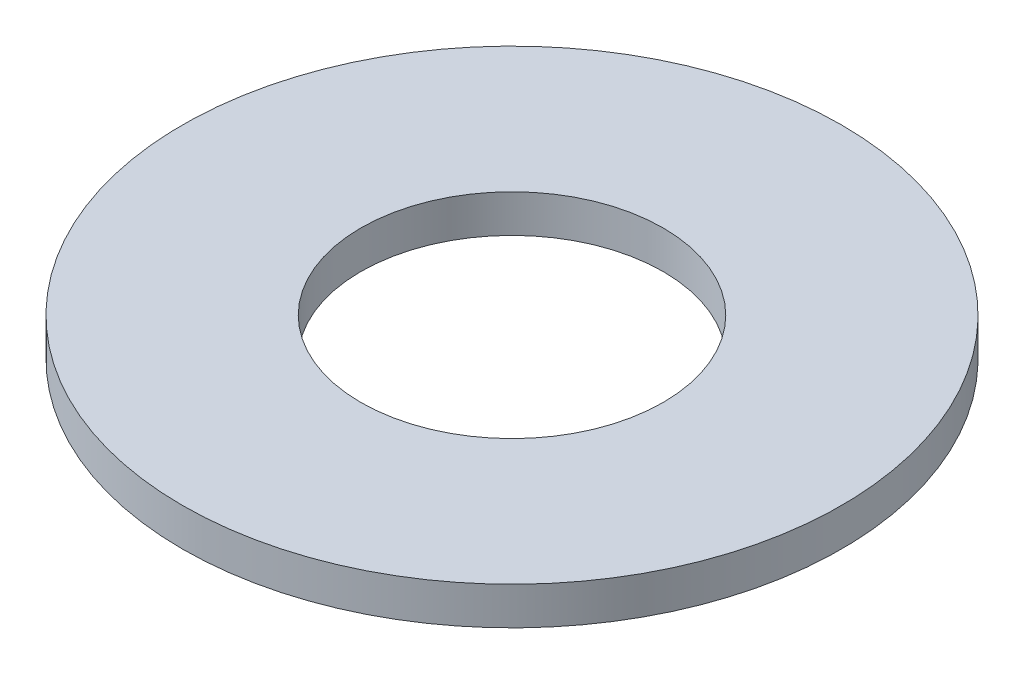
ISO-10303-21;
HEADER;
FILE_DESCRIPTION(('STEP AP214'),'2;1');
FILE_NAME('part.step','',(''),(''),'','','');
FILE_SCHEMA(('AUTOMOTIVE_DESIGN { 1 0 10303 214 1 1 1 1 }'));
ENDSEC;
DATA;
#1=APPLICATION_CONTEXT('core data for automotive mechanical design processes');
#2=APPLICATION_PROTOCOL_DEFINITION('international standard','automotive_design',2000,#1);
#3=PRODUCT_CONTEXT('',#1,'mechanical');
#4=PRODUCT('Part','Part','',(#3));
#5=PRODUCT_RELATED_PRODUCT_CATEGORY('part','',(#4));
#6=PRODUCT_DEFINITION_FORMATION('','',#4);
#7=PRODUCT_DEFINITION_CONTEXT('part definition',#1,'design');
#8=PRODUCT_DEFINITION('design','',#6,#7);
#9=PRODUCT_DEFINITION_SHAPE('','',#8);
#10=(LENGTH_UNIT() NAMED_UNIT(*) SI_UNIT(.MILLI.,.METRE.));
#11=(NAMED_UNIT(*) PLANE_ANGLE_UNIT() SI_UNIT($,.RADIAN.));
#12=(NAMED_UNIT(*) SI_UNIT($,.STERADIAN.) SOLID_ANGLE_UNIT());
#13=UNCERTAINTY_MEASURE_WITH_UNIT(LENGTH_MEASURE(1.E-05),#10,'distance_accuracy_value','');
#14=(GEOMETRIC_REPRESENTATION_CONTEXT(3) GLOBAL_UNCERTAINTY_ASSIGNED_CONTEXT((#13)) GLOBAL_UNIT_ASSIGNED_CONTEXT((#10,
#11,#12)) REPRESENTATION_CONTEXT('',''));
#15=CARTESIAN_POINT('',(0.,0.,0.));
#16=DIRECTION('',(0.,0.,1.));
#17=DIRECTION('',(1.,0.,0.));
#18=AXIS2_PLACEMENT_3D('',#15,#16,#17);
#19=CARTESIAN_POINT('',(0.,1.0922,0.));
#20=DIRECTION('',(0.,-1.,0.));
#21=DIRECTION('',(0.,0.,-1.));
#22=AXIS2_PLACEMENT_3D('',#19,#20,#21);
#23=CYLINDRICAL_SURFACE('',#22,9.525);
#24=CARTESIAN_POINT('',(0.,1.0922,0.));
#25=DIRECTION('',(0.,1.,0.));
#26=DIRECTION('',(0.,0.,1.));
#27=AXIS2_PLACEMENT_3D('',#24,#25,#26);
#28=CIRCLE('',#27,9.525);
#29=CARTESIAN_POINT('',(0.,1.0922,9.525));
#30=VERTEX_POINT('',#29);
#31=EDGE_CURVE('E10',#30,#30,#28,.T.);
#32=ORIENTED_EDGE('',*,*,#31,.F.);
#33=EDGE_LOOP('',(#32));
#34=FACE_BOUND('',#33,.T.);
#35=CARTESIAN_POINT('',(0.,0.,0.));
#36=DIRECTION('',(0.,1.,0.));
#37=DIRECTION('',(0.,0.,1.));
#38=AXIS2_PLACEMENT_3D('',#35,#36,#37);
#39=CIRCLE('',#38,9.525);
#40=CARTESIAN_POINT('',(0.,0.,9.525));
#41=VERTEX_POINT('',#40);
#42=EDGE_CURVE('E33',#41,#41,#39,.T.);
#43=ORIENTED_EDGE('',*,*,#42,.T.);
#44=EDGE_LOOP('',(#43));
#45=FACE_BOUND('',#44,.T.);
#46=ADVANCED_FACE('F30',(#34,#45),#23,.T.);
#47=CARTESIAN_POINT('',(0.,1.0922,0.));
#48=DIRECTION('',(0.,1.,0.));
#49=DIRECTION('',(0.,0.,1.));
#50=AXIS2_PLACEMENT_3D('',#47,#48,#49);
#51=PLANE('',#50);
#52=CARTESIAN_POINT('',(0.,1.0922,0.));
#53=DIRECTION('',(0.,1.,0.));
#54=DIRECTION('',(0.,0.,1.));
#55=AXIS2_PLACEMENT_3D('',#52,#53,#54);
#56=CIRCLE('',#55,4.3688);
#57=CARTESIAN_POINT('',(0.,1.0922,4.3688));
#58=VERTEX_POINT('',#57);
#59=EDGE_CURVE('E42',#58,#58,#56,.T.);
#60=ORIENTED_EDGE('',*,*,#59,.F.);
#61=EDGE_LOOP('',(#60));
#62=FACE_BOUND('',#61,.T.);
#63=ORIENTED_EDGE('',*,*,#31,.T.);
#64=EDGE_LOOP('',(#63));
#65=FACE_BOUND('',#64,.T.);
#66=ADVANCED_FACE('F57',(#62,#65),#51,.T.);
#67=CARTESIAN_POINT('',(0.,0.,0.));
#68=DIRECTION('',(0.,1.,0.));
#69=DIRECTION('',(0.,0.,1.));
#70=AXIS2_PLACEMENT_3D('',#67,#68,#69);
#71=PLANE('',#70);
#72=CARTESIAN_POINT('',(0.,0.,0.));
#73=DIRECTION('',(0.,1.,0.));
#74=DIRECTION('',(0.,0.,1.));
#75=AXIS2_PLACEMENT_3D('',#72,#73,#74);
#76=CIRCLE('',#75,4.3688);
#77=CARTESIAN_POINT('',(0.,0.,4.3688));
#78=VERTEX_POINT('',#77);
#79=EDGE_CURVE('E40',#78,#78,#76,.T.);
#80=ORIENTED_EDGE('',*,*,#79,.T.);
#81=EDGE_LOOP('',(#80));
#82=FACE_BOUND('',#81,.T.);
#83=ORIENTED_EDGE('',*,*,#42,.F.);
#84=EDGE_LOOP('',(#83));
#85=FACE_BOUND('',#84,.T.);
#86=ADVANCED_FACE('F48',(#82,#85),#71,.F.);
#87=CARTESIAN_POINT('',(0.,0.,0.));
#88=DIRECTION('',(0.,1.,0.));
#89=DIRECTION('',(0.,0.,1.));
#90=AXIS2_PLACEMENT_3D('',#87,#88,#89);
#91=CYLINDRICAL_SURFACE('',#90,4.3688);
#92=ORIENTED_EDGE('',*,*,#79,.F.);
#93=EDGE_LOOP('',(#92));
#94=FACE_BOUND('',#93,.T.);
#95=ORIENTED_EDGE('',*,*,#59,.T.);
#96=EDGE_LOOP('',(#95));
#97=FACE_BOUND('',#96,.T.);
#98=ADVANCED_FACE('F51',(#94,#97),#91,.F.);
#99=CLOSED_SHELL('',(#46,#66,#86,#98));
#100=MANIFOLD_SOLID_BREP('B2',#99);
#101=ADVANCED_BREP_SHAPE_REPRESENTATION('',(#18,#100),#14);
#102=SHAPE_DEFINITION_REPRESENTATION(#9,#101);
ENDSEC;
END-ISO-10303-21;
